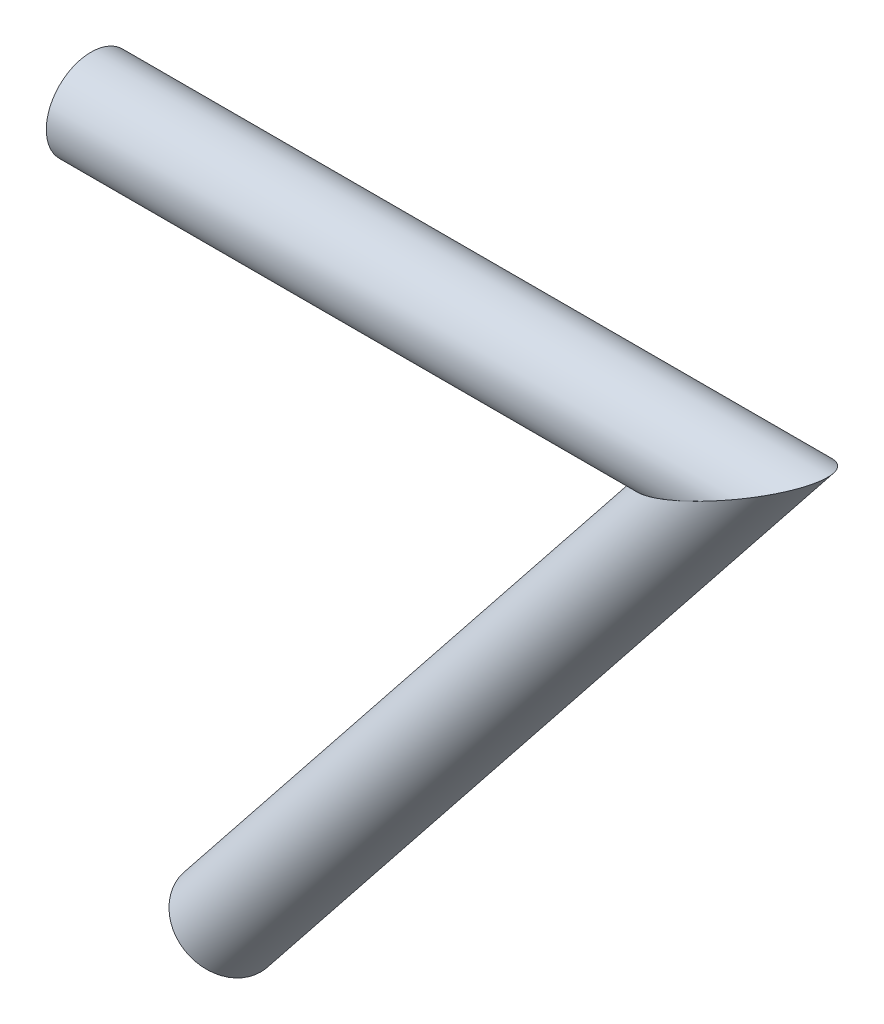
ISO-10303-21;
HEADER;
FILE_DESCRIPTION(('STEP AP214'),'2;1');
FILE_NAME('part.step','',(''),(''),'','','');
FILE_SCHEMA(('AUTOMOTIVE_DESIGN { 1 0 10303 214 1 1 1 1 }'));
ENDSEC;
DATA;
#1=APPLICATION_CONTEXT('core data for automotive mechanical design processes');
#2=APPLICATION_PROTOCOL_DEFINITION('international standard','automotive_design',2000,#1);
#3=PRODUCT_CONTEXT('',#1,'mechanical');
#4=PRODUCT('Part','Part','',(#3));
#5=PRODUCT_RELATED_PRODUCT_CATEGORY('part','',(#4));
#6=PRODUCT_DEFINITION_FORMATION('','',#4);
#7=PRODUCT_DEFINITION_CONTEXT('part definition',#1,'design');
#8=PRODUCT_DEFINITION('design','',#6,#7);
#9=PRODUCT_DEFINITION_SHAPE('','',#8);
#10=(LENGTH_UNIT() NAMED_UNIT(*) SI_UNIT(.MILLI.,.METRE.));
#11=(NAMED_UNIT(*) PLANE_ANGLE_UNIT() SI_UNIT($,.RADIAN.));
#12=(NAMED_UNIT(*) SI_UNIT($,.STERADIAN.) SOLID_ANGLE_UNIT());
#13=UNCERTAINTY_MEASURE_WITH_UNIT(LENGTH_MEASURE(1.E-05),#10,'distance_accuracy_value','');
#14=(GEOMETRIC_REPRESENTATION_CONTEXT(3) GLOBAL_UNCERTAINTY_ASSIGNED_CONTEXT((#13)) GLOBAL_UNIT_ASSIGNED_CONTEXT((#10,
#11,#12)) REPRESENTATION_CONTEXT('',''));
#15=CARTESIAN_POINT('',(0.,0.,0.));
#16=DIRECTION('',(0.,0.,1.));
#17=DIRECTION('',(1.,0.,0.));
#18=AXIS2_PLACEMENT_3D('',#15,#16,#17);
#19=CARTESIAN_POINT('',(87.2946359144081,109.625821846001,0.));
#20=DIRECTION('',(-0.622926781769704,-0.782280144548,0.));
#21=DIRECTION('',(0.782280144548,-0.622926781769704,0.));
#22=AXIS2_PLACEMENT_3D('',#19,#20,#21);
#23=CYLINDRICAL_SURFACE('',#22,30.);
#24=CARTESIAN_POINT('',(-1.80411241501588E-13,0.,0.));
#25=DIRECTION('',(0.434208025162073,-0.900812628066932,0.));
#26=DIRECTION('',(-0.900812628066932,-0.434208025162073,0.));
#27=AXIS2_PLACEMENT_3D('',#24,#25,#26);
#28=ELLIPSE('',#27,69.0913070729222,30.);
#29=CARTESIAN_POINT('',(-62.2383219009386,-30.,0.));
#30=VERTEX_POINT('',#29);
#31=EDGE_CURVE('E49',#30,#30,#28,.F.);
#32=ORIENTED_EDGE('',*,*,#31,.F.);
#33=EDGE_LOOP('',(#32));
#34=FACE_BOUND('',#33,.T.);
#35=CARTESIAN_POINT('',(-341.379845008045,-428.7095728008,0.));
#36=DIRECTION('',(-0.622926781769704,-0.782280144548,0.));
#37=DIRECTION('',(0.782280144548,-0.622926781769704,0.));
#38=AXIS2_PLACEMENT_3D('',#35,#36,#37);
#39=CIRCLE('',#38,30.);
#40=CARTESIAN_POINT('',(-317.911440671605,-447.397376253891,0.));
#41=VERTEX_POINT('',#40);
#42=EDGE_CURVE('E53',#41,#41,#39,.T.);
#43=ORIENTED_EDGE('',*,*,#42,.F.);
#44=EDGE_LOOP('',(#43));
#45=FACE_BOUND('',#44,.T.);
#46=ADVANCED_FACE('F43',(#34,#45),#23,.T.);
#47=CARTESIAN_POINT('',(-341.379845008045,-428.7095728008,0.));
#48=DIRECTION('',(-0.622926781769704,-0.782280144548,0.));
#49=DIRECTION('',(0.782280144548,-0.622926781769704,0.));
#50=AXIS2_PLACEMENT_3D('',#47,#48,#49);
#51=PLANE('',#50);
#52=CARTESIAN_POINT('',(-341.379845008045,-428.7095728008,0.));
#53=DIRECTION('',(-0.622926781769704,-0.782280144548,0.));
#54=DIRECTION('',(0.782280144548,-0.622926781769704,0.));
#55=AXIS2_PLACEMENT_3D('',#52,#53,#54);
#56=CIRCLE('',#55,27.);
#57=CARTESIAN_POINT('',(-320.258281105249,-445.528595908582,0.));
#58=VERTEX_POINT('',#57);
#59=EDGE_CURVE('E58',#58,#58,#56,.T.);
#60=ORIENTED_EDGE('',*,*,#59,.F.);
#61=EDGE_LOOP('',(#60));
#62=FACE_BOUND('',#61,.T.);
#63=ORIENTED_EDGE('',*,*,#42,.T.);
#64=EDGE_LOOP('',(#63));
#65=FACE_BOUND('',#64,.T.);
#66=ADVANCED_FACE('F65',(#62,#65),#51,.T.);
#67=CARTESIAN_POINT('',(87.2946359144081,109.625821846001,0.));
#68=DIRECTION('',(-0.622926781769704,-0.782280144548,0.));
#69=DIRECTION('',(0.782280144548,-0.622926781769704,0.));
#70=AXIS2_PLACEMENT_3D('',#67,#68,#69);
#71=CYLINDRICAL_SURFACE('',#70,27.);
#72=CARTESIAN_POINT('',(-1.80411241501588E-13,0.,0.));
#73=DIRECTION('',(0.434208025162073,-0.900812628066932,0.));
#74=DIRECTION('',(-0.900812628066932,-0.434208025162073,0.));
#75=AXIS2_PLACEMENT_3D('',#72,#73,#74);
#76=ELLIPSE('',#75,62.18217636563,27.);
#77=CARTESIAN_POINT('',(-56.0144897108448,-27.,0.));
#78=VERTEX_POINT('',#77);
#79=EDGE_CURVE('E11',#78,#78,#76,.F.);
#80=ORIENTED_EDGE('',*,*,#79,.T.);
#81=EDGE_LOOP('',(#80));
#82=FACE_BOUND('',#81,.T.);
#83=ORIENTED_EDGE('',*,*,#59,.T.);
#84=EDGE_LOOP('',(#83));
#85=FACE_BOUND('',#84,.T.);
#86=ADVANCED_FACE('F63',(#82,#85),#71,.F.);
#87=CARTESIAN_POINT('',(0.,0.,0.));
#88=DIRECTION('',(0.434208025162073,-0.900812628066932,0.));
#89=DIRECTION('',(0.900812628066932,0.434208025162073,0.));
#90=AXIS2_PLACEMENT_3D('',#87,#88,#89);
#91=PLANE('',#90);
#92=ORIENTED_EDGE('',*,*,#31,.T.);
#93=EDGE_LOOP('',(#92));
#94=FACE_BOUND('',#93,.T.);
#95=ORIENTED_EDGE('',*,*,#79,.F.);
#96=EDGE_LOOP('',(#95));
#97=FACE_BOUND('',#96,.T.);
#98=ADVANCED_FACE('F84',(#94,#97),#91,.F.);
#99=CLOSED_SHELL('',(#46,#66,#86,#98));
#100=MANIFOLD_SOLID_BREP('B2',#99);
#101=CARTESIAN_POINT('',(140.136270375804,0.,0.));
#102=DIRECTION('',(-1.,0.,0.));
#103=DIRECTION('',(0.,0.,1.));
#104=AXIS2_PLACEMENT_3D('',#101,#102,#103);
#105=CYLINDRICAL_SURFACE('',#104,30.);
#106=CARTESIAN_POINT('',(-431.785416421385,0.,0.));
#107=DIRECTION('',(1.,0.,0.));
#108=DIRECTION('',(0.,0.,-1.));
#109=AXIS2_PLACEMENT_3D('',#106,#107,#108);
#110=CIRCLE('',#109,30.);
#111=CARTESIAN_POINT('',(-431.785416421385,0.,-30.));
#112=VERTEX_POINT('',#111);
#113=EDGE_CURVE('E112',#112,#112,#110,.T.);
#114=ORIENTED_EDGE('',*,*,#113,.T.);
#115=EDGE_LOOP('',(#114));
#116=FACE_BOUND('',#115,.T.);
#117=CARTESIAN_POINT('',(0.,0.,0.));
#118=DIRECTION('',(0.434208025162073,-0.900812628066932,0.));
#119=DIRECTION('',(-0.900812628066932,-0.434208025162073,0.));
#120=AXIS2_PLACEMENT_3D('',#117,#118,#119);
#121=ELLIPSE('',#120,69.0913070729223,30.);
#122=CARTESIAN_POINT('',(-62.2383219009386,-30.,0.));
#123=VERTEX_POINT('',#122);
#124=EDGE_CURVE('E42',#123,#123,#121,.T.);
#125=ORIENTED_EDGE('',*,*,#124,.F.);
#126=EDGE_LOOP('',(#125));
#127=FACE_BOUND('',#126,.T.);
#128=ADVANCED_FACE('F105',(#116,#127),#105,.T.);
#129=CARTESIAN_POINT('',(-431.785416421385,0.,0.));
#130=DIRECTION('',(1.,0.,0.));
#131=DIRECTION('',(0.,0.,-1.));
#132=AXIS2_PLACEMENT_3D('',#129,#130,#131);
#133=PLANE('',#132);
#134=ORIENTED_EDGE('',*,*,#113,.F.);
#135=EDGE_LOOP('',(#134));
#136=FACE_BOUND('',#135,.T.);
#137=CARTESIAN_POINT('',(-431.785416421385,0.,0.));
#138=DIRECTION('',(1.,0.,0.));
#139=DIRECTION('',(0.,0.,-1.));
#140=AXIS2_PLACEMENT_3D('',#137,#138,#139);
#141=CIRCLE('',#140,27.);
#142=CARTESIAN_POINT('',(-431.785416421385,0.,-27.));
#143=VERTEX_POINT('',#142);
#144=EDGE_CURVE('E117',#143,#143,#141,.T.);
#145=ORIENTED_EDGE('',*,*,#144,.T.);
#146=EDGE_LOOP('',(#145));
#147=FACE_BOUND('',#146,.T.);
#148=ADVANCED_FACE('F133',(#136,#147),#133,.F.);
#149=CARTESIAN_POINT('',(140.136270375804,0.,0.));
#150=DIRECTION('',(-1.,0.,0.));
#151=DIRECTION('',(0.,0.,1.));
#152=AXIS2_PLACEMENT_3D('',#149,#150,#151);
#153=CYLINDRICAL_SURFACE('',#152,27.);
#154=ORIENTED_EDGE('',*,*,#144,.F.);
#155=EDGE_LOOP('',(#154));
#156=FACE_BOUND('',#155,.T.);
#157=CARTESIAN_POINT('',(0.,0.,0.));
#158=DIRECTION('',(0.434208025162073,-0.900812628066932,0.));
#159=DIRECTION('',(-0.900812628066932,-0.434208025162073,0.));
#160=AXIS2_PLACEMENT_3D('',#157,#158,#159);
#161=ELLIPSE('',#160,62.1821763656301,27.);
#162=CARTESIAN_POINT('',(-56.0144897108447,-27.,0.));
#163=VERTEX_POINT('',#162);
#164=EDGE_CURVE('E108',#163,#163,#161,.T.);
#165=ORIENTED_EDGE('',*,*,#164,.T.);
#166=EDGE_LOOP('',(#165));
#167=FACE_BOUND('',#166,.T.);
#168=ADVANCED_FACE('F125',(#156,#167),#153,.F.);
#169=CARTESIAN_POINT('',(0.,0.,0.));
#170=DIRECTION('',(0.434208025162073,-0.900812628066932,0.));
#171=DIRECTION('',(0.900812628066932,0.434208025162073,0.));
#172=AXIS2_PLACEMENT_3D('',#169,#170,#171);
#173=PLANE('',#172);
#174=ORIENTED_EDGE('',*,*,#164,.F.);
#175=EDGE_LOOP('',(#174));
#176=FACE_BOUND('',#175,.T.);
#177=ORIENTED_EDGE('',*,*,#124,.T.);
#178=EDGE_LOOP('',(#177));
#179=FACE_BOUND('',#178,.T.);
#180=ADVANCED_FACE('F127',(#176,#179),#173,.T.);
#181=CLOSED_SHELL('',(#128,#148,#168,#180));
#182=MANIFOLD_SOLID_BREP('B6',#181);
#183=ADVANCED_BREP_SHAPE_REPRESENTATION('',(#18,#100,#182),#14);
#184=SHAPE_DEFINITION_REPRESENTATION(#9,#183);
ENDSEC;
END-ISO-10303-21;
